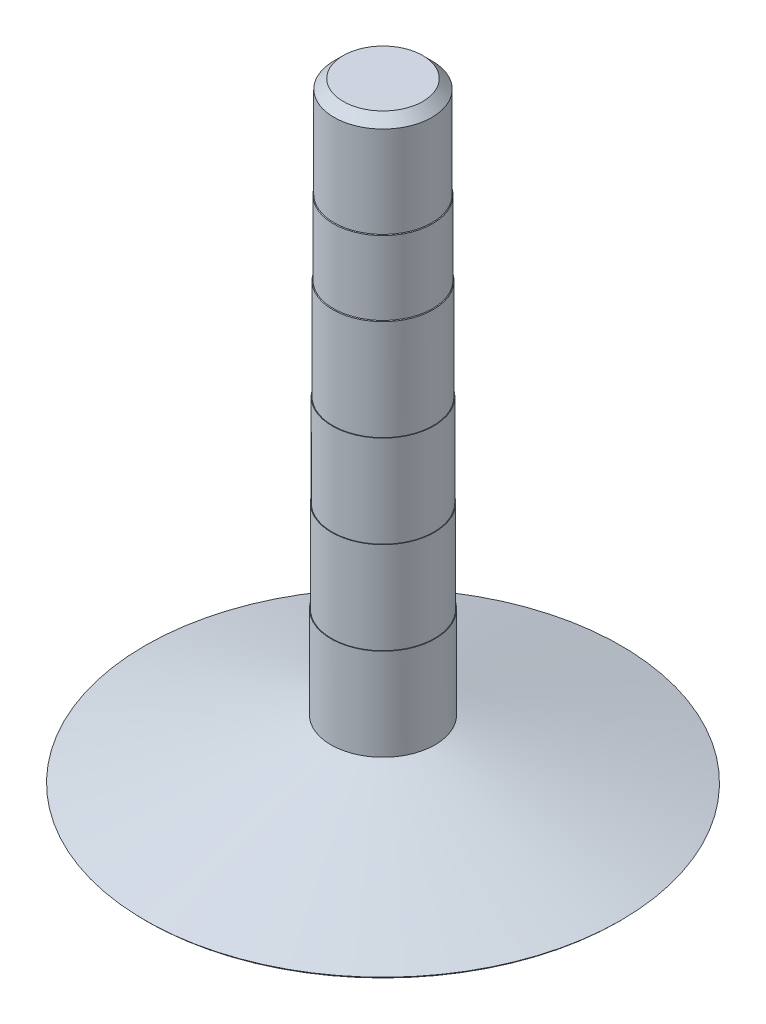
ISO-10303-21;
HEADER;
FILE_DESCRIPTION(('STEP AP214'),'2;1');
FILE_NAME('part.step','',(''),(''),'','','');
FILE_SCHEMA(('AUTOMOTIVE_DESIGN { 1 0 10303 214 1 1 1 1 }'));
ENDSEC;
DATA;
#1=APPLICATION_CONTEXT('core data for automotive mechanical design processes');
#2=APPLICATION_PROTOCOL_DEFINITION('international standard','automotive_design',2000,#1);
#3=PRODUCT_CONTEXT('',#1,'mechanical');
#4=PRODUCT('Part','Part','',(#3));
#5=PRODUCT_RELATED_PRODUCT_CATEGORY('part','',(#4));
#6=PRODUCT_DEFINITION_FORMATION('','',#4);
#7=PRODUCT_DEFINITION_CONTEXT('part definition',#1,'design');
#8=PRODUCT_DEFINITION('design','',#6,#7);
#9=PRODUCT_DEFINITION_SHAPE('','',#8);
#10=(LENGTH_UNIT() NAMED_UNIT(*) SI_UNIT(.MILLI.,.METRE.));
#11=(NAMED_UNIT(*) PLANE_ANGLE_UNIT() SI_UNIT($,.RADIAN.));
#12=(NAMED_UNIT(*) SI_UNIT($,.STERADIAN.) SOLID_ANGLE_UNIT());
#13=UNCERTAINTY_MEASURE_WITH_UNIT(LENGTH_MEASURE(1.E-05),#10,'distance_accuracy_value','');
#14=(GEOMETRIC_REPRESENTATION_CONTEXT(3) GLOBAL_UNCERTAINTY_ASSIGNED_CONTEXT((#13)) GLOBAL_UNIT_ASSIGNED_CONTEXT((#10,
#11,#12)) REPRESENTATION_CONTEXT('',''));
#15=CARTESIAN_POINT('',(0.,0.,0.));
#16=DIRECTION('',(0.,0.,1.));
#17=DIRECTION('',(1.,0.,0.));
#18=AXIS2_PLACEMENT_3D('',#15,#16,#17);
#19=CARTESIAN_POINT('',(0.,-12.5,0.));
#20=DIRECTION('',(0.,1.,0.));
#21=DIRECTION('',(-1.,0.,0.));
#22=AXIS2_PLACEMENT_3D('',#19,#20,#21);
#23=PLANE('',#22);
#24=CARTESIAN_POINT('',(0.,-12.5,0.));
#25=DIRECTION('',(0.,1.,0.));
#26=DIRECTION('',(-1.,0.,0.));
#27=AXIS2_PLACEMENT_3D('',#24,#25,#26);
#28=CIRCLE('',#27,4.25);
#29=CARTESIAN_POINT('',(-4.24999999999999,-12.5,0.));
#30=VERTEX_POINT('',#29);
#31=EDGE_CURVE('E66',#30,#30,#28,.T.);
#32=ORIENTED_EDGE('',*,*,#31,.T.);
#33=EDGE_LOOP('',(#32));
#34=FACE_BOUND('',#33,.T.);
#35=CARTESIAN_POINT('',(0.,-12.5,0.));
#36=DIRECTION('',(0.,1.,0.));
#37=DIRECTION('',(-1.,0.,0.));
#38=AXIS2_PLACEMENT_3D('',#35,#36,#37);
#39=CIRCLE('',#38,4.2);
#40=CARTESIAN_POINT('',(-4.2,-12.5,0.));
#41=VERTEX_POINT('',#40);
#42=EDGE_CURVE('E84',#41,#41,#39,.T.);
#43=ORIENTED_EDGE('',*,*,#42,.F.);
#44=EDGE_LOOP('',(#43));
#45=FACE_BOUND('',#44,.T.);
#46=ADVANCED_FACE('F33',(#34,#45),#23,.T.);
#47=CARTESIAN_POINT('',(0.,37.2711916256361,0.));
#48=DIRECTION('',(0.,1.,0.));
#49=DIRECTION('',(-1.,0.,0.));
#50=AXIS2_PLACEMENT_3D('',#47,#48,#49);
#51=CYLINDRICAL_SURFACE('',#50,4.25);
#52=CARTESIAN_POINT('',(0.,-20.,0.));
#53=DIRECTION('',(0.,1.,0.));
#54=DIRECTION('',(-1.,0.,0.));
#55=AXIS2_PLACEMENT_3D('',#52,#53,#54);
#56=CIRCLE('',#55,4.24999999999999);
#57=CARTESIAN_POINT('',(4.25,-20.,0.));
#58=VERTEX_POINT('',#57);
#59=EDGE_CURVE('E69',#58,#58,#56,.T.);
#60=ORIENTED_EDGE('',*,*,#59,.T.);
#61=EDGE_LOOP('',(#60));
#62=FACE_BOUND('',#61,.T.);
#63=ORIENTED_EDGE('',*,*,#31,.F.);
#64=EDGE_LOOP('',(#63));
#65=FACE_BOUND('',#64,.T.);
#66=ADVANCED_FACE('F92',(#62,#65),#51,.T.);
#67=CARTESIAN_POINT('',(0.,-20.,0.));
#68=DIRECTION('',(0.,-1.,0.));
#69=DIRECTION('',(1.,0.,0.));
#70=AXIS2_PLACEMENT_3D('',#67,#68,#69);
#71=CONICAL_SURFACE('',#70,4.24999999999999,1.26339885367207);
#72=CARTESIAN_POINT('',(0.,-24.8192771084337,0.));
#73=DIRECTION('',(0.,-1.,0.));
#74=DIRECTION('',(1.,0.,0.));
#75=AXIS2_PLACEMENT_3D('',#72,#73,#74);
#76=CIRCLE('',#75,19.4307228915662);
#77=CARTESIAN_POINT('',(19.4307228915662,-24.8192771084337,0.));
#78=VERTEX_POINT('',#77);
#79=EDGE_CURVE('E57',#78,#78,#76,.F.);
#80=CARTESIAN_POINT('',(19.4307228915662,-24.8192771084337,0.));
#81=CARTESIAN_POINT('',(19.2725903614458,-24.7690763052209,0.));
#82=CARTESIAN_POINT('',(19.1144578313253,-24.718875502008,0.));
#83=CARTESIAN_POINT('',(18.7981927710843,-24.6184738955823,0.));
#84=CARTESIAN_POINT('',(18.6400602409638,-24.5682730923695,0.));
#85=CARTESIAN_POINT('',(18.3237951807229,-24.4678714859438,0.));
#86=CARTESIAN_POINT('',(18.1656626506024,-24.4176706827309,0.));
#87=CARTESIAN_POINT('',(17.8493975903614,-24.3172690763052,0.));
#88=CARTESIAN_POINT('',(17.6912650602409,-24.2670682730924,0.));
#89=CARTESIAN_POINT('',(17.375,-24.1666666666667,0.));
#90=CARTESIAN_POINT('',(17.2168674698795,-24.1164658634538,0.));
#91=CARTESIAN_POINT('',(16.9006024096385,-24.0160642570281,0.));
#92=CARTESIAN_POINT('',(16.7424698795181,-23.9658634538153,0.));
#93=CARTESIAN_POINT('',(16.4262048192771,-23.8654618473896,0.));
#94=CARTESIAN_POINT('',(16.2680722891566,-23.8152610441767,0.));
#95=CARTESIAN_POINT('',(15.9518072289156,-23.714859437751,0.));
#96=CARTESIAN_POINT('',(15.7936746987952,-23.6646586345382,0.));
#97=CARTESIAN_POINT('',(15.4774096385542,-23.5642570281125,0.));
#98=CARTESIAN_POINT('',(15.3192771084337,-23.5140562248996,0.));
#99=CARTESIAN_POINT('',(15.0030120481928,-23.4136546184739,0.));
#100=CARTESIAN_POINT('',(14.8448795180723,-23.363453815261,0.));
#101=CARTESIAN_POINT('',(14.5286144578313,-23.2630522088353,0.));
#102=CARTESIAN_POINT('',(14.3704819277108,-23.2128514056225,0.));
#103=CARTESIAN_POINT('',(14.0542168674699,-23.1124497991968,0.));
#104=CARTESIAN_POINT('',(13.8960843373494,-23.0622489959839,0.));
#105=CARTESIAN_POINT('',(13.5798192771084,-22.9618473895582,0.));
#106=CARTESIAN_POINT('',(13.4216867469879,-22.9116465863454,0.));
#107=CARTESIAN_POINT('',(13.105421686747,-22.8112449799197,0.));
#108=CARTESIAN_POINT('',(12.9472891566265,-22.7610441767068,0.));
#109=CARTESIAN_POINT('',(12.6310240963855,-22.6606425702811,0.));
#110=CARTESIAN_POINT('',(12.472891566265,-22.6104417670683,0.));
#111=CARTESIAN_POINT('',(12.1566265060241,-22.5100401606426,0.));
#112=CARTESIAN_POINT('',(11.9984939759036,-22.4598393574297,0.));
#113=CARTESIAN_POINT('',(11.6822289156626,-22.359437751004,0.));
#114=CARTESIAN_POINT('',(11.5240963855422,-22.3092369477912,0.));
#115=CARTESIAN_POINT('',(11.2078313253012,-22.2088353413655,0.));
#116=CARTESIAN_POINT('',(11.0496987951807,-22.1586345381526,0.));
#117=CARTESIAN_POINT('',(10.7334337349397,-22.0582329317269,0.));
#118=CARTESIAN_POINT('',(10.5753012048193,-22.0080321285141,0.));
#119=CARTESIAN_POINT('',(10.2590361445783,-21.9076305220884,0.));
#120=CARTESIAN_POINT('',(10.1009036144578,-21.8574297188755,0.));
#121=CARTESIAN_POINT('',(9.78463855421686,-21.7570281124498,0.));
#122=CARTESIAN_POINT('',(9.62650602409638,-21.7068273092369,0.));
#123=CARTESIAN_POINT('',(9.31024096385541,-21.6064257028112,0.));
#124=CARTESIAN_POINT('',(9.15210843373493,-21.5562248995984,0.));
#125=CARTESIAN_POINT('',(8.83584337349397,-21.4558232931727,0.));
#126=CARTESIAN_POINT('',(8.67771084337349,-21.4056224899598,0.));
#127=CARTESIAN_POINT('',(8.36144578313252,-21.3052208835341,0.));
#128=CARTESIAN_POINT('',(8.20331325301204,-21.2550200803213,0.));
#129=CARTESIAN_POINT('',(7.88704819277108,-21.1546184738956,0.));
#130=CARTESIAN_POINT('',(7.7289156626506,-21.1044176706827,0.));
#131=CARTESIAN_POINT('',(7.41265060240963,-21.004016064257,0.));
#132=CARTESIAN_POINT('',(7.25451807228915,-20.9538152610442,0.));
#133=CARTESIAN_POINT('',(6.93825301204819,-20.8534136546185,0.));
#134=CARTESIAN_POINT('',(6.78012048192771,-20.8032128514056,0.));
#135=CARTESIAN_POINT('',(6.46385542168674,-20.7028112449799,0.));
#136=CARTESIAN_POINT('',(6.30572289156626,-20.6526104417671,0.));
#137=CARTESIAN_POINT('',(5.9894578313253,-20.5522088353414,0.));
#138=CARTESIAN_POINT('',(5.83132530120482,-20.5020080321285,0.));
#139=CARTESIAN_POINT('',(5.51506024096386,-20.4016064257028,0.));
#140=CARTESIAN_POINT('',(5.35692771084337,-20.35140562249,0.));
#141=CARTESIAN_POINT('',(5.04066265060241,-20.2510040160643,0.));
#142=CARTESIAN_POINT('',(4.88253012048193,-20.2008032128514,0.));
#143=CARTESIAN_POINT('',(4.56626506024096,-20.1004016064257,0.));
#144=CARTESIAN_POINT('',(4.40813253012048,-20.0502008032129,0.));
#145=CARTESIAN_POINT('',(4.25,-20.,0.));
#146=B_SPLINE_CURVE_WITH_KNOTS('',3,(#80,#81,#82,#83,#84,#85,#86,#87,#88,#89,#90,#91,#92,#93,
#94,#95,#96,#97,#98,#99,#100,#101,#102,#103,#104,#105,#106,#107,#108,#109,#110,#111,#112,#113,
#114,#115,#116,#117,#118,#119,#120,#121,#122,#123,#124,#125,#126,#127,#128,#129,#130,#131,#132,
#133,#134,#135,#136,#137,#138,#139,#140,#141,#142,#143,#144,#145),.UNSPECIFIED.,.F.,.F.,(4,2,2,
2,2,2,2,2,2,2,2,2,2,2,2,2,2,2,2,2,2,2,2,2,2,2,2,2,2,2,2,2,4),(0.,0.497729002098214,
0.995458004196429,1.49318700629464,1.99091600839286,2.48864501049107,2.98637401258928,
3.4841030146875,3.98183201678571,4.47956101888393,4.97729002098214,5.47501902308035,
5.97274802517857,6.47047702727678,6.968206029375,7.46593503147321,7.96366403357142,
8.46139303566964,8.95912203776785,9.45685103986607,9.95458004196428,10.4523090440625,
10.9500380461607,11.4477670482589,11.9454960503571,12.4432250524554,12.9409540545536,
13.4386830566518,13.93641205875,14.4341410608482,14.9318700629464,15.4295990650446,
15.9273280671429),.UNSPECIFIED.);
#147=EDGE_CURVE('BSEAM98',#78,#58,#146,.T.);
#148=ORIENTED_EDGE('',*,*,#79,.T.);
#149=ORIENTED_EDGE('',*,*,#59,.F.);
#150=ORIENTED_EDGE('',*,*,#147,.T.);
#151=ORIENTED_EDGE('',*,*,#147,.F.);
#152=EDGE_LOOP('',(#148,#150,#149,#151));
#153=FACE_BOUND('',#152,.T.);
#154=ADVANCED_FACE('F98',(#153),#71,.T.);
#155=CARTESIAN_POINT('',(0.,-25.,0.));
#156=DIRECTION('',(0.,1.,0.));
#157=DIRECTION('',(-1.,0.,0.));
#158=AXIS2_PLACEMENT_3D('',#155,#156,#157);
#159=PLANE('',#158);
#160=CARTESIAN_POINT('',(0.,-25.,0.));
#161=DIRECTION('',(0.,1.,0.));
#162=DIRECTION('',(-1.,0.,0.));
#163=AXIS2_PLACEMENT_3D('',#160,#161,#162);
#164=CIRCLE('',#163,19.25);
#165=CARTESIAN_POINT('',(-19.25,-25.,0.));
#166=VERTEX_POINT('',#165);
#167=EDGE_CURVE('E54',#166,#166,#164,.F.);
#168=ORIENTED_EDGE('',*,*,#167,.T.);
#169=EDGE_LOOP('',(#168));
#170=FACE_BOUND('',#169,.T.);
#171=ADVANCED_FACE('F149',(#170),#159,.F.);
#172=CARTESIAN_POINT('',(0.,25.,0.));
#173=DIRECTION('',(0.,-1.,0.));
#174=DIRECTION('',(1.,0.,0.));
#175=AXIS2_PLACEMENT_3D('',#172,#173,#174);
#176=PLANE('',#175);
#177=CARTESIAN_POINT('',(0.,25.,0.));
#178=DIRECTION('',(0.,-1.,0.));
#179=DIRECTION('',(1.,0.,0.));
#180=AXIS2_PLACEMENT_3D('',#177,#178,#179);
#181=CIRCLE('',#180,3.25);
#182=CARTESIAN_POINT('',(3.25,25.,0.));
#183=VERTEX_POINT('',#182);
#184=EDGE_CURVE('E63',#183,#183,#181,.F.);
#185=ORIENTED_EDGE('',*,*,#184,.T.);
#186=EDGE_LOOP('',(#185));
#187=FACE_BOUND('',#186,.T.);
#188=ADVANCED_FACE('F143',(#187),#176,.F.);
#189=CARTESIAN_POINT('',(0.,37.2711916256361,0.));
#190=DIRECTION('',(0.,1.,0.));
#191=DIRECTION('',(-1.,0.,0.));
#192=AXIS2_PLACEMENT_3D('',#189,#190,#191);
#193=CYLINDRICAL_SURFACE('',#192,4.);
#194=CARTESIAN_POINT('',(0.,16.8,0.));
#195=DIRECTION('',(0.,-1.,0.));
#196=DIRECTION('',(1.,0.,0.));
#197=AXIS2_PLACEMENT_3D('',#194,#195,#196);
#198=CIRCLE('',#197,4.);
#199=CARTESIAN_POINT('',(4.00000000000001,16.8,0.));
#200=VERTEX_POINT('',#199);
#201=EDGE_CURVE('E41',#200,#200,#198,.F.);
#202=ORIENTED_EDGE('',*,*,#201,.T.);
#203=EDGE_LOOP('',(#202));
#204=FACE_BOUND('',#203,.T.);
#205=CARTESIAN_POINT('',(0.,24.25,0.));
#206=DIRECTION('',(0.,-1.,0.));
#207=DIRECTION('',(1.,0.,0.));
#208=AXIS2_PLACEMENT_3D('',#205,#206,#207);
#209=CIRCLE('',#208,4.);
#210=CARTESIAN_POINT('',(4.00000000000001,24.25,0.));
#211=VERTEX_POINT('',#210);
#212=EDGE_CURVE('E60',#211,#211,#209,.T.);
#213=ORIENTED_EDGE('',*,*,#212,.T.);
#214=EDGE_LOOP('',(#213));
#215=FACE_BOUND('',#214,.T.);
#216=ADVANCED_FACE('F133',(#204,#215),#193,.T.);
#217=CARTESIAN_POINT('',(0.,37.2711916256361,0.));
#218=DIRECTION('',(0.,1.,0.));
#219=DIRECTION('',(-1.,0.,0.));
#220=AXIS2_PLACEMENT_3D('',#217,#218,#219);
#221=CYLINDRICAL_SURFACE('',#220,4.05);
#222=CARTESIAN_POINT('',(0.,16.75,0.));
#223=DIRECTION('',(0.,-1.,0.));
#224=DIRECTION('',(1.,0.,0.));
#225=AXIS2_PLACEMENT_3D('',#222,#223,#224);
#226=CIRCLE('',#225,4.05);
#227=CARTESIAN_POINT('',(4.05,16.75,0.));
#228=VERTEX_POINT('',#227);
#229=EDGE_CURVE('E45',#228,#228,#226,.T.);
#230=ORIENTED_EDGE('',*,*,#229,.T.);
#231=EDGE_LOOP('',(#230));
#232=FACE_BOUND('',#231,.T.);
#233=CARTESIAN_POINT('',(0.,10.75,0.));
#234=DIRECTION('',(0.,-1.,0.));
#235=DIRECTION('',(1.,0.,0.));
#236=AXIS2_PLACEMENT_3D('',#233,#234,#235);
#237=CIRCLE('',#236,4.05);
#238=CARTESIAN_POINT('',(4.05,10.75,0.));
#239=VERTEX_POINT('',#238);
#240=EDGE_CURVE('E49',#239,#239,#237,.F.);
#241=ORIENTED_EDGE('',*,*,#240,.T.);
#242=EDGE_LOOP('',(#241));
#243=FACE_BOUND('',#242,.T.);
#244=ADVANCED_FACE('F129',(#232,#243),#221,.T.);
#245=CARTESIAN_POINT('',(0.,37.2711916256361,0.));
#246=DIRECTION('',(0.,1.,0.));
#247=DIRECTION('',(-1.,0.,0.));
#248=AXIS2_PLACEMENT_3D('',#245,#246,#247);
#249=CYLINDRICAL_SURFACE('',#248,4.1);
#250=CARTESIAN_POINT('',(0.,10.7,0.));
#251=DIRECTION('',(0.,-1.,0.));
#252=DIRECTION('',(1.,0.,0.));
#253=AXIS2_PLACEMENT_3D('',#250,#251,#252);
#254=CIRCLE('',#253,4.1);
#255=CARTESIAN_POINT('',(4.1,10.7,0.));
#256=VERTEX_POINT('',#255);
#257=EDGE_CURVE('E10',#256,#256,#254,.T.);
#258=ORIENTED_EDGE('',*,*,#257,.T.);
#259=EDGE_LOOP('',(#258));
#260=FACE_BOUND('',#259,.T.);
#261=CARTESIAN_POINT('',(0.,2.5,0.));
#262=DIRECTION('',(0.,1.,0.));
#263=DIRECTION('',(-1.,0.,0.));
#264=AXIS2_PLACEMENT_3D('',#261,#262,#263);
#265=CIRCLE('',#264,4.1);
#266=CARTESIAN_POINT('',(-4.1,2.5,0.));
#267=VERTEX_POINT('',#266);
#268=EDGE_CURVE('E72',#267,#267,#265,.T.);
#269=ORIENTED_EDGE('',*,*,#268,.T.);
#270=EDGE_LOOP('',(#269));
#271=FACE_BOUND('',#270,.T.);
#272=ADVANCED_FACE('F132',(#260,#271),#249,.T.);
#273=CARTESIAN_POINT('',(0.,2.5,0.));
#274=DIRECTION('',(0.,1.,0.));
#275=DIRECTION('',(-1.,0.,0.));
#276=AXIS2_PLACEMENT_3D('',#273,#274,#275);
#277=PLANE('',#276);
#278=CARTESIAN_POINT('',(0.,2.5,0.));
#279=DIRECTION('',(0.,1.,0.));
#280=DIRECTION('',(-1.,0.,0.));
#281=AXIS2_PLACEMENT_3D('',#278,#279,#280);
#282=CIRCLE('',#281,4.15);
#283=CARTESIAN_POINT('',(-4.15,2.5,0.));
#284=VERTEX_POINT('',#283);
#285=EDGE_CURVE('E75',#284,#284,#282,.T.);
#286=ORIENTED_EDGE('',*,*,#285,.T.);
#287=EDGE_LOOP('',(#286));
#288=FACE_BOUND('',#287,.T.);
#289=ORIENTED_EDGE('',*,*,#268,.F.);
#290=EDGE_LOOP('',(#289));
#291=FACE_BOUND('',#290,.T.);
#292=ADVANCED_FACE('F141',(#288,#291),#277,.T.);
#293=CARTESIAN_POINT('',(0.,37.2711916256361,0.));
#294=DIRECTION('',(0.,1.,0.));
#295=DIRECTION('',(-1.,0.,0.));
#296=AXIS2_PLACEMENT_3D('',#293,#294,#295);
#297=CYLINDRICAL_SURFACE('',#296,4.15);
#298=CARTESIAN_POINT('',(0.,-5.,0.));
#299=DIRECTION('',(0.,1.,0.));
#300=DIRECTION('',(-1.,0.,0.));
#301=AXIS2_PLACEMENT_3D('',#298,#299,#300);
#302=CIRCLE('',#301,4.15);
#303=CARTESIAN_POINT('',(-4.15,-5.,0.));
#304=VERTEX_POINT('',#303);
#305=EDGE_CURVE('E78',#304,#304,#302,.T.);
#306=ORIENTED_EDGE('',*,*,#305,.T.);
#307=EDGE_LOOP('',(#306));
#308=FACE_BOUND('',#307,.T.);
#309=ORIENTED_EDGE('',*,*,#285,.F.);
#310=EDGE_LOOP('',(#309));
#311=FACE_BOUND('',#310,.T.);
#312=ADVANCED_FACE('F226',(#308,#311),#297,.T.);
#313=CARTESIAN_POINT('',(0.,-5.,0.));
#314=DIRECTION('',(0.,1.,0.));
#315=DIRECTION('',(-1.,0.,0.));
#316=AXIS2_PLACEMENT_3D('',#313,#314,#315);
#317=PLANE('',#316);
#318=CARTESIAN_POINT('',(0.,-5.,0.));
#319=DIRECTION('',(0.,1.,0.));
#320=DIRECTION('',(-1.,0.,0.));
#321=AXIS2_PLACEMENT_3D('',#318,#319,#320);
#322=CIRCLE('',#321,4.2);
#323=CARTESIAN_POINT('',(-4.2,-5.,0.));
#324=VERTEX_POINT('',#323);
#325=EDGE_CURVE('E81',#324,#324,#322,.T.);
#326=ORIENTED_EDGE('',*,*,#325,.T.);
#327=EDGE_LOOP('',(#326));
#328=FACE_BOUND('',#327,.T.);
#329=ORIENTED_EDGE('',*,*,#305,.F.);
#330=EDGE_LOOP('',(#329));
#331=FACE_BOUND('',#330,.T.);
#332=ADVANCED_FACE('F220',(#328,#331),#317,.T.);
#333=CARTESIAN_POINT('',(0.,37.2711916256361,0.));
#334=DIRECTION('',(0.,1.,0.));
#335=DIRECTION('',(-1.,0.,0.));
#336=AXIS2_PLACEMENT_3D('',#333,#334,#335);
#337=CYLINDRICAL_SURFACE('',#336,4.2);
#338=ORIENTED_EDGE('',*,*,#42,.T.);
#339=EDGE_LOOP('',(#338));
#340=FACE_BOUND('',#339,.T.);
#341=ORIENTED_EDGE('',*,*,#325,.F.);
#342=EDGE_LOOP('',(#341));
#343=FACE_BOUND('',#342,.T.);
#344=ADVANCED_FACE('F88',(#340,#343),#337,.T.);
#345=CARTESIAN_POINT('',(0.,25.,0.));
#346=DIRECTION('',(0.,-1.,0.));
#347=DIRECTION('',(1.,0.,0.));
#348=AXIS2_PLACEMENT_3D('',#345,#346,#347);
#349=CONICAL_SURFACE('',#348,3.25,0.785398163397447);
#350=ORIENTED_EDGE('',*,*,#212,.F.);
#351=EDGE_LOOP('',(#350));
#352=FACE_BOUND('',#351,.T.);
#353=ORIENTED_EDGE('',*,*,#184,.F.);
#354=EDGE_LOOP('',(#353));
#355=FACE_BOUND('',#354,.T.);
#356=ADVANCED_FACE('F104',(#352,#355),#349,.T.);
#357=CARTESIAN_POINT('',(0.,-24.8192771084337,0.));
#358=DIRECTION('',(0.,1.,0.));
#359=DIRECTION('',(-1.,0.,0.));
#360=AXIS2_PLACEMENT_3D('',#357,#358,#359);
#361=CONICAL_SURFACE('',#360,19.4307228915662,0.785398163397439);
#362=ORIENTED_EDGE('',*,*,#167,.F.);
#363=EDGE_LOOP('',(#362));
#364=FACE_BOUND('',#363,.T.);
#365=ORIENTED_EDGE('',*,*,#79,.F.);
#366=EDGE_LOOP('',(#365));
#367=FACE_BOUND('',#366,.T.);
#368=ADVANCED_FACE('F110',(#364,#367),#361,.T.);
#369=CARTESIAN_POINT('',(0.,17.5,0.));
#370=DIRECTION('',(0.,-1.,0.));
#371=DIRECTION('',(1.,0.,0.));
#372=AXIS2_PLACEMENT_3D('',#369,#370,#371);
#373=CONICAL_SURFACE('',#372,3.29999999999999,0.785398163397454);
#374=ORIENTED_EDGE('',*,*,#229,.F.);
#375=EDGE_LOOP('',(#374));
#376=FACE_BOUND('',#375,.T.);
#377=ORIENTED_EDGE('',*,*,#201,.F.);
#378=EDGE_LOOP('',(#377));
#379=FACE_BOUND('',#378,.T.);
#380=ADVANCED_FACE('F116',(#376,#379),#373,.T.);
#381=CARTESIAN_POINT('',(0.,10.75,0.));
#382=DIRECTION('',(0.,-1.,0.));
#383=DIRECTION('',(1.,0.,0.));
#384=AXIS2_PLACEMENT_3D('',#381,#382,#383);
#385=CONICAL_SURFACE('',#384,4.05,0.785398163397442);
#386=ORIENTED_EDGE('',*,*,#257,.F.);
#387=EDGE_LOOP('',(#386));
#388=FACE_BOUND('',#387,.T.);
#389=ORIENTED_EDGE('',*,*,#240,.F.);
#390=EDGE_LOOP('',(#389));
#391=FACE_BOUND('',#390,.T.);
#392=ADVANCED_FACE('F36',(#388,#391),#385,.T.);
#393=CLOSED_SHELL('',(#46,#66,#154,#171,#188,#216,#244,#272,#292,#312,#332,#344,#356,#368,#380,#392));
#394=MANIFOLD_SOLID_BREP('B2',#393);
#395=ADVANCED_BREP_SHAPE_REPRESENTATION('',(#18,#394),#14);
#396=SHAPE_DEFINITION_REPRESENTATION(#9,#395);
ENDSEC;
END-ISO-10303-21;
